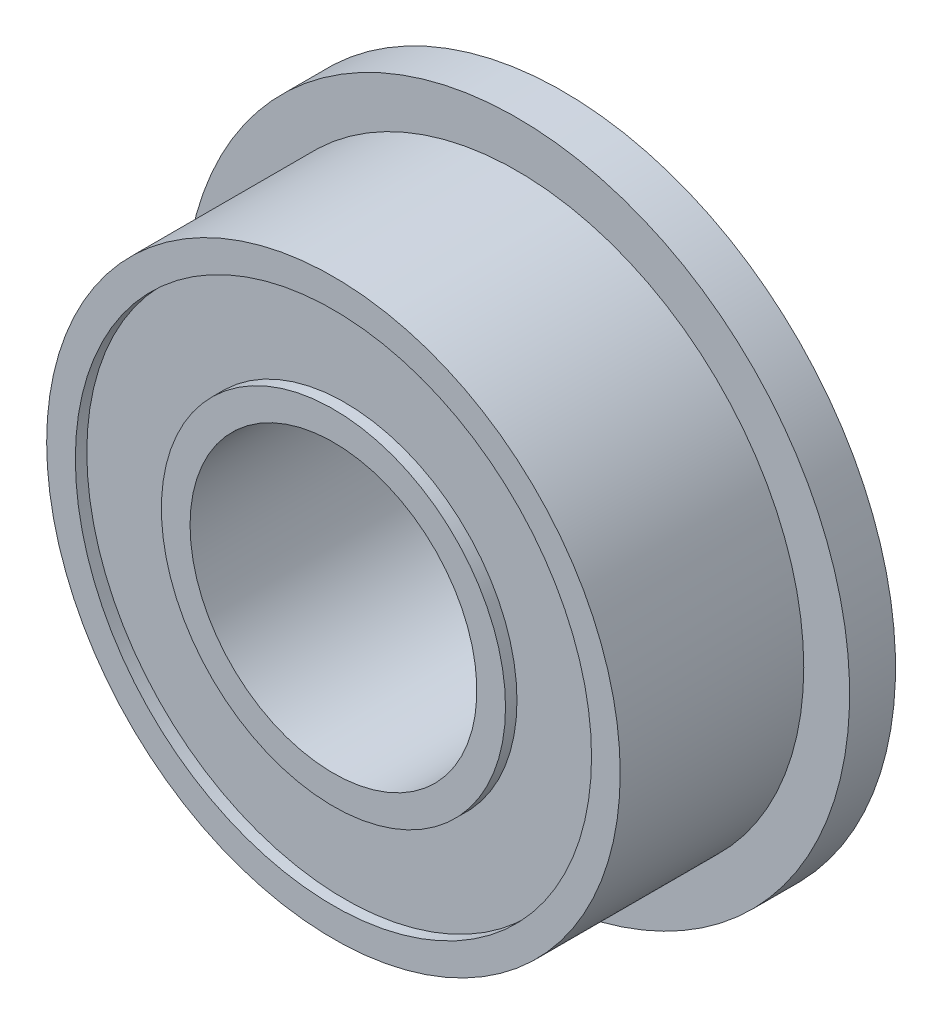
ISO-10303-21;
HEADER;
FILE_DESCRIPTION(('STEP AP214'),'2;1');
FILE_NAME('part.step','',(''),(''),'','','');
FILE_SCHEMA(('AUTOMOTIVE_DESIGN { 1 0 10303 214 1 1 1 1 }'));
ENDSEC;
DATA;
#1=APPLICATION_CONTEXT('core data for automotive mechanical design processes');
#2=APPLICATION_PROTOCOL_DEFINITION('international standard','automotive_design',2000,#1);
#3=PRODUCT_CONTEXT('',#1,'mechanical');
#4=PRODUCT('Part','Part','',(#3));
#5=PRODUCT_RELATED_PRODUCT_CATEGORY('part','',(#4));
#6=PRODUCT_DEFINITION_FORMATION('','',#4);
#7=PRODUCT_DEFINITION_CONTEXT('part definition',#1,'design');
#8=PRODUCT_DEFINITION('design','',#6,#7);
#9=PRODUCT_DEFINITION_SHAPE('','',#8);
#10=(LENGTH_UNIT() NAMED_UNIT(*) SI_UNIT(.MILLI.,.METRE.));
#11=(NAMED_UNIT(*) PLANE_ANGLE_UNIT() SI_UNIT($,.RADIAN.));
#12=(NAMED_UNIT(*) SI_UNIT($,.STERADIAN.) SOLID_ANGLE_UNIT());
#13=UNCERTAINTY_MEASURE_WITH_UNIT(LENGTH_MEASURE(1.E-05),#10,'distance_accuracy_value','');
#14=(GEOMETRIC_REPRESENTATION_CONTEXT(3) GLOBAL_UNCERTAINTY_ASSIGNED_CONTEXT((#13)) GLOBAL_UNIT_ASSIGNED_CONTEXT((#10,
#11,#12)) REPRESENTATION_CONTEXT('',''));
#15=CARTESIAN_POINT('',(0.,0.,0.));
#16=DIRECTION('',(0.,0.,1.));
#17=DIRECTION('',(1.,0.,0.));
#18=AXIS2_PLACEMENT_3D('',#15,#16,#17);
#19=CARTESIAN_POINT('',(0.,0.,4.));
#20=DIRECTION('',(0.,0.,1.));
#21=DIRECTION('',(1.,0.,0.));
#22=AXIS2_PLACEMENT_3D('',#19,#20,#21);
#23=PLANE('',#22);
#24=CARTESIAN_POINT('',(0.,0.,4.));
#25=DIRECTION('',(0.,0.,-1.));
#26=DIRECTION('',(-1.,0.,0.));
#27=AXIS2_PLACEMENT_3D('',#24,#25,#26);
#28=CIRCLE('',#27,2.5);
#29=CARTESIAN_POINT('',(-2.5,0.,4.));
#30=VERTEX_POINT('',#29);
#31=EDGE_CURVE('E56',#30,#30,#28,.T.);
#32=ORIENTED_EDGE('',*,*,#31,.T.);
#33=EDGE_LOOP('',(#32));
#34=FACE_BOUND('',#33,.T.);
#35=CARTESIAN_POINT('',(0.,0.,4.));
#36=DIRECTION('',(0.,0.,1.));
#37=DIRECTION('',(1.,0.,0.));
#38=AXIS2_PLACEMENT_3D('',#35,#36,#37);
#39=CIRCLE('',#38,3.);
#40=CARTESIAN_POINT('',(3.,0.,4.));
#41=VERTEX_POINT('',#40);
#42=EDGE_CURVE('E82',#41,#41,#39,.T.);
#43=ORIENTED_EDGE('',*,*,#42,.T.);
#44=EDGE_LOOP('',(#43));
#45=FACE_BOUND('',#44,.T.);
#46=ADVANCED_FACE('F37',(#34,#45),#23,.T.);
#47=CARTESIAN_POINT('',(0.,0.,0.));
#48=DIRECTION('',(0.,0.,1.));
#49=DIRECTION('',(1.,0.,0.));
#50=AXIS2_PLACEMENT_3D('',#47,#48,#49);
#51=PLANE('',#50);
#52=CARTESIAN_POINT('',(0.,0.,0.));
#53=DIRECTION('',(0.,0.,-1.));
#54=DIRECTION('',(-1.,0.,0.));
#55=AXIS2_PLACEMENT_3D('',#52,#53,#54);
#56=CIRCLE('',#55,2.5);
#57=CARTESIAN_POINT('',(-2.5,0.,0.));
#58=VERTEX_POINT('',#57);
#59=EDGE_CURVE('E58',#58,#58,#56,.T.);
#60=ORIENTED_EDGE('',*,*,#59,.F.);
#61=EDGE_LOOP('',(#60));
#62=FACE_BOUND('',#61,.T.);
#63=CARTESIAN_POINT('',(0.,0.,0.));
#64=DIRECTION('',(0.,0.,-1.));
#65=DIRECTION('',(-1.,0.,0.));
#66=AXIS2_PLACEMENT_3D('',#63,#64,#65);
#67=CIRCLE('',#66,3.3);
#68=CARTESIAN_POINT('',(-3.3,0.,0.));
#69=VERTEX_POINT('',#68);
#70=EDGE_CURVE('E70',#69,#69,#67,.T.);
#71=ORIENTED_EDGE('',*,*,#70,.T.);
#72=EDGE_LOOP('',(#71));
#73=FACE_BOUND('',#72,.T.);
#74=ADVANCED_FACE('F115',(#62,#73),#51,.F.);
#75=CARTESIAN_POINT('',(0.,0.,4.));
#76=DIRECTION('',(0.,0.,-1.));
#77=DIRECTION('',(-1.,0.,0.));
#78=AXIS2_PLACEMENT_3D('',#75,#76,#77);
#79=CYLINDRICAL_SURFACE('',#78,5.);
#80=CARTESIAN_POINT('',(0.,0.,4.));
#81=DIRECTION('',(0.,0.,1.));
#82=DIRECTION('',(1.,0.,0.));
#83=AXIS2_PLACEMENT_3D('',#80,#81,#82);
#84=CIRCLE('',#83,5.);
#85=CARTESIAN_POINT('',(5.,0.,4.));
#86=VERTEX_POINT('',#85);
#87=EDGE_CURVE('E44',#86,#86,#84,.T.);
#88=ORIENTED_EDGE('',*,*,#87,.F.);
#89=EDGE_LOOP('',(#88));
#90=FACE_BOUND('',#89,.T.);
#91=CARTESIAN_POINT('',(0.,0.,0.8));
#92=DIRECTION('',(0.,0.,-1.));
#93=DIRECTION('',(-1.,0.,0.));
#94=AXIS2_PLACEMENT_3D('',#91,#92,#93);
#95=CIRCLE('',#94,5.);
#96=CARTESIAN_POINT('',(-5.,0.,0.8));
#97=VERTEX_POINT('',#96);
#98=EDGE_CURVE('E10',#97,#97,#95,.T.);
#99=ORIENTED_EDGE('',*,*,#98,.F.);
#100=EDGE_LOOP('',(#99));
#101=FACE_BOUND('',#100,.T.);
#102=ADVANCED_FACE('F39',(#90,#101),#79,.T.);
#103=CARTESIAN_POINT('',(0.,0.,4.));
#104=DIRECTION('',(0.,0.,1.));
#105=DIRECTION('',(1.,0.,0.));
#106=AXIS2_PLACEMENT_3D('',#103,#104,#105);
#107=CIRCLE('',#106,4.5);
#108=CARTESIAN_POINT('',(4.5,0.,4.));
#109=VERTEX_POINT('',#108);
#110=EDGE_CURVE('E76',#109,#109,#107,.T.);
#111=ORIENTED_EDGE('',*,*,#110,.F.);
#112=EDGE_LOOP('',(#111));
#113=FACE_BOUND('',#112,.T.);
#114=ORIENTED_EDGE('',*,*,#87,.T.);
#115=EDGE_LOOP('',(#114));
#116=FACE_BOUND('',#115,.T.);
#117=ADVANCED_FACE('F104',(#113,#116),#23,.T.);
#118=CARTESIAN_POINT('',(0.,0.,0.8));
#119=DIRECTION('',(0.,0.,-1.));
#120=DIRECTION('',(-1.,0.,0.));
#121=AXIS2_PLACEMENT_3D('',#118,#119,#120);
#122=CYLINDRICAL_SURFACE('',#121,5.8);
#123=CARTESIAN_POINT('',(0.,0.,0.8));
#124=DIRECTION('',(0.,0.,-1.));
#125=DIRECTION('',(-1.,0.,0.));
#126=AXIS2_PLACEMENT_3D('',#123,#124,#125);
#127=CIRCLE('',#126,5.8);
#128=CARTESIAN_POINT('',(-5.8,0.,0.8));
#129=VERTEX_POINT('',#128);
#130=EDGE_CURVE('E48',#129,#129,#127,.T.);
#131=ORIENTED_EDGE('',*,*,#130,.T.);
#132=EDGE_LOOP('',(#131));
#133=FACE_BOUND('',#132,.T.);
#134=CARTESIAN_POINT('',(0.,0.,0.));
#135=DIRECTION('',(0.,0.,-1.));
#136=DIRECTION('',(-1.,0.,0.));
#137=AXIS2_PLACEMENT_3D('',#134,#135,#136);
#138=CIRCLE('',#137,5.8);
#139=CARTESIAN_POINT('',(-5.8,0.,0.));
#140=VERTEX_POINT('',#139);
#141=EDGE_CURVE('E52',#140,#140,#138,.T.);
#142=ORIENTED_EDGE('',*,*,#141,.F.);
#143=EDGE_LOOP('',(#142));
#144=FACE_BOUND('',#143,.T.);
#145=ADVANCED_FACE('F106',(#133,#144),#122,.T.);
#146=CARTESIAN_POINT('',(0.,0.,0.8));
#147=DIRECTION('',(0.,0.,-1.));
#148=DIRECTION('',(-1.,0.,0.));
#149=AXIS2_PLACEMENT_3D('',#146,#147,#148);
#150=PLANE('',#149);
#151=ORIENTED_EDGE('',*,*,#98,.T.);
#152=EDGE_LOOP('',(#151));
#153=FACE_BOUND('',#152,.T.);
#154=ORIENTED_EDGE('',*,*,#130,.F.);
#155=EDGE_LOOP('',(#154));
#156=FACE_BOUND('',#155,.T.);
#157=ADVANCED_FACE('F112',(#153,#156),#150,.F.);
#158=CARTESIAN_POINT('',(0.,0.,0.));
#159=DIRECTION('',(0.,0.,-1.));
#160=DIRECTION('',(-1.,0.,0.));
#161=AXIS2_PLACEMENT_3D('',#158,#159,#160);
#162=CIRCLE('',#161,5.1);
#163=CARTESIAN_POINT('',(-5.1,0.,0.));
#164=VERTEX_POINT('',#163);
#165=EDGE_CURVE('E64',#164,#164,#162,.T.);
#166=ORIENTED_EDGE('',*,*,#165,.F.);
#167=EDGE_LOOP('',(#166));
#168=FACE_BOUND('',#167,.T.);
#169=ORIENTED_EDGE('',*,*,#141,.T.);
#170=EDGE_LOOP('',(#169));
#171=FACE_BOUND('',#170,.T.);
#172=ADVANCED_FACE('F123',(#168,#171),#51,.F.);
#173=CARTESIAN_POINT('',(0.,0.,4.));
#174=DIRECTION('',(0.,0.,-1.));
#175=DIRECTION('',(-1.,0.,0.));
#176=AXIS2_PLACEMENT_3D('',#173,#174,#175);
#177=CYLINDRICAL_SURFACE('',#176,2.5);
#178=ORIENTED_EDGE('',*,*,#31,.F.);
#179=EDGE_LOOP('',(#178));
#180=FACE_BOUND('',#179,.T.);
#181=ORIENTED_EDGE('',*,*,#59,.T.);
#182=EDGE_LOOP('',(#181));
#183=FACE_BOUND('',#182,.T.);
#184=ADVANCED_FACE('F142',(#180,#183),#177,.F.);
#185=CARTESIAN_POINT('',(0.,0.,0.2));
#186=DIRECTION('',(0.,0.,-1.));
#187=DIRECTION('',(-1.,0.,0.));
#188=AXIS2_PLACEMENT_3D('',#185,#186,#187);
#189=CYLINDRICAL_SURFACE('',#188,5.1);
#190=CARTESIAN_POINT('',(0.,0.,0.2));
#191=DIRECTION('',(0.,0.,-1.));
#192=DIRECTION('',(-1.,0.,0.));
#193=AXIS2_PLACEMENT_3D('',#190,#191,#192);
#194=CIRCLE('',#193,5.1);
#195=CARTESIAN_POINT('',(-5.1,0.,0.2));
#196=VERTEX_POINT('',#195);
#197=EDGE_CURVE('E61',#196,#196,#194,.T.);
#198=ORIENTED_EDGE('',*,*,#197,.F.);
#199=EDGE_LOOP('',(#198));
#200=FACE_BOUND('',#199,.T.);
#201=ORIENTED_EDGE('',*,*,#165,.T.);
#202=EDGE_LOOP('',(#201));
#203=FACE_BOUND('',#202,.T.);
#204=ADVANCED_FACE('F138',(#200,#203),#189,.F.);
#205=CARTESIAN_POINT('',(0.,0.,0.2));
#206=DIRECTION('',(0.,0.,-1.));
#207=DIRECTION('',(-1.,0.,0.));
#208=AXIS2_PLACEMENT_3D('',#205,#206,#207);
#209=PLANE('',#208);
#210=CARTESIAN_POINT('',(0.,0.,0.2));
#211=DIRECTION('',(0.,0.,-1.));
#212=DIRECTION('',(-1.,0.,0.));
#213=AXIS2_PLACEMENT_3D('',#210,#211,#212);
#214=CIRCLE('',#213,3.3);
#215=CARTESIAN_POINT('',(-3.3,0.,0.2));
#216=VERTEX_POINT('',#215);
#217=EDGE_CURVE('E67',#216,#216,#214,.T.);
#218=ORIENTED_EDGE('',*,*,#217,.F.);
#219=EDGE_LOOP('',(#218));
#220=FACE_BOUND('',#219,.T.);
#221=ORIENTED_EDGE('',*,*,#197,.T.);
#222=EDGE_LOOP('',(#221));
#223=FACE_BOUND('',#222,.T.);
#224=ADVANCED_FACE('F134',(#220,#223),#209,.T.);
#225=CARTESIAN_POINT('',(0.,0.,0.2));
#226=DIRECTION('',(0.,0.,-1.));
#227=DIRECTION('',(-1.,0.,0.));
#228=AXIS2_PLACEMENT_3D('',#225,#226,#227);
#229=CYLINDRICAL_SURFACE('',#228,3.3);
#230=ORIENTED_EDGE('',*,*,#217,.T.);
#231=EDGE_LOOP('',(#230));
#232=FACE_BOUND('',#231,.T.);
#233=ORIENTED_EDGE('',*,*,#70,.F.);
#234=EDGE_LOOP('',(#233));
#235=FACE_BOUND('',#234,.T.);
#236=ADVANCED_FACE('F100',(#232,#235),#229,.T.);
#237=CARTESIAN_POINT('',(0.,0.,3.8));
#238=DIRECTION('',(0.,0.,1.));
#239=DIRECTION('',(1.,0.,0.));
#240=AXIS2_PLACEMENT_3D('',#237,#238,#239);
#241=CYLINDRICAL_SURFACE('',#240,4.5);
#242=CARTESIAN_POINT('',(0.,0.,3.8));
#243=DIRECTION('',(0.,0.,1.));
#244=DIRECTION('',(1.,0.,0.));
#245=AXIS2_PLACEMENT_3D('',#242,#243,#244);
#246=CIRCLE('',#245,4.5);
#247=CARTESIAN_POINT('',(4.5,0.,3.8));
#248=VERTEX_POINT('',#247);
#249=EDGE_CURVE('E73',#248,#248,#246,.T.);
#250=ORIENTED_EDGE('',*,*,#249,.F.);
#251=EDGE_LOOP('',(#250));
#252=FACE_BOUND('',#251,.T.);
#253=ORIENTED_EDGE('',*,*,#110,.T.);
#254=EDGE_LOOP('',(#253));
#255=FACE_BOUND('',#254,.T.);
#256=ADVANCED_FACE('F94',(#252,#255),#241,.F.);
#257=CARTESIAN_POINT('',(0.,0.,3.8));
#258=DIRECTION('',(0.,0.,1.));
#259=DIRECTION('',(1.,0.,0.));
#260=AXIS2_PLACEMENT_3D('',#257,#258,#259);
#261=PLANE('',#260);
#262=CARTESIAN_POINT('',(0.,0.,3.8));
#263=DIRECTION('',(0.,0.,1.));
#264=DIRECTION('',(1.,0.,0.));
#265=AXIS2_PLACEMENT_3D('',#262,#263,#264);
#266=CIRCLE('',#265,3.);
#267=CARTESIAN_POINT('',(3.,0.,3.8));
#268=VERTEX_POINT('',#267);
#269=EDGE_CURVE('E79',#268,#268,#266,.T.);
#270=ORIENTED_EDGE('',*,*,#269,.F.);
#271=EDGE_LOOP('',(#270));
#272=FACE_BOUND('',#271,.T.);
#273=ORIENTED_EDGE('',*,*,#249,.T.);
#274=EDGE_LOOP('',(#273));
#275=FACE_BOUND('',#274,.T.);
#276=ADVANCED_FACE('F91',(#272,#275),#261,.T.);
#277=CARTESIAN_POINT('',(0.,0.,3.8));
#278=DIRECTION('',(0.,0.,1.));
#279=DIRECTION('',(1.,0.,0.));
#280=AXIS2_PLACEMENT_3D('',#277,#278,#279);
#281=CYLINDRICAL_SURFACE('',#280,3.);
#282=ORIENTED_EDGE('',*,*,#269,.T.);
#283=EDGE_LOOP('',(#282));
#284=FACE_BOUND('',#283,.T.);
#285=ORIENTED_EDGE('',*,*,#42,.F.);
#286=EDGE_LOOP('',(#285));
#287=FACE_BOUND('',#286,.T.);
#288=ADVANCED_FACE('F88',(#284,#287),#281,.T.);
#289=CLOSED_SHELL('',(#46,#74,#102,#117,#145,#157,#172,#184,#204,#224,#236,#256,#276,#288));
#290=MANIFOLD_SOLID_BREP('B2',#289);
#291=ADVANCED_BREP_SHAPE_REPRESENTATION('',(#18,#290),#14);
#292=SHAPE_DEFINITION_REPRESENTATION(#9,#291);
ENDSEC;
END-ISO-10303-21;
